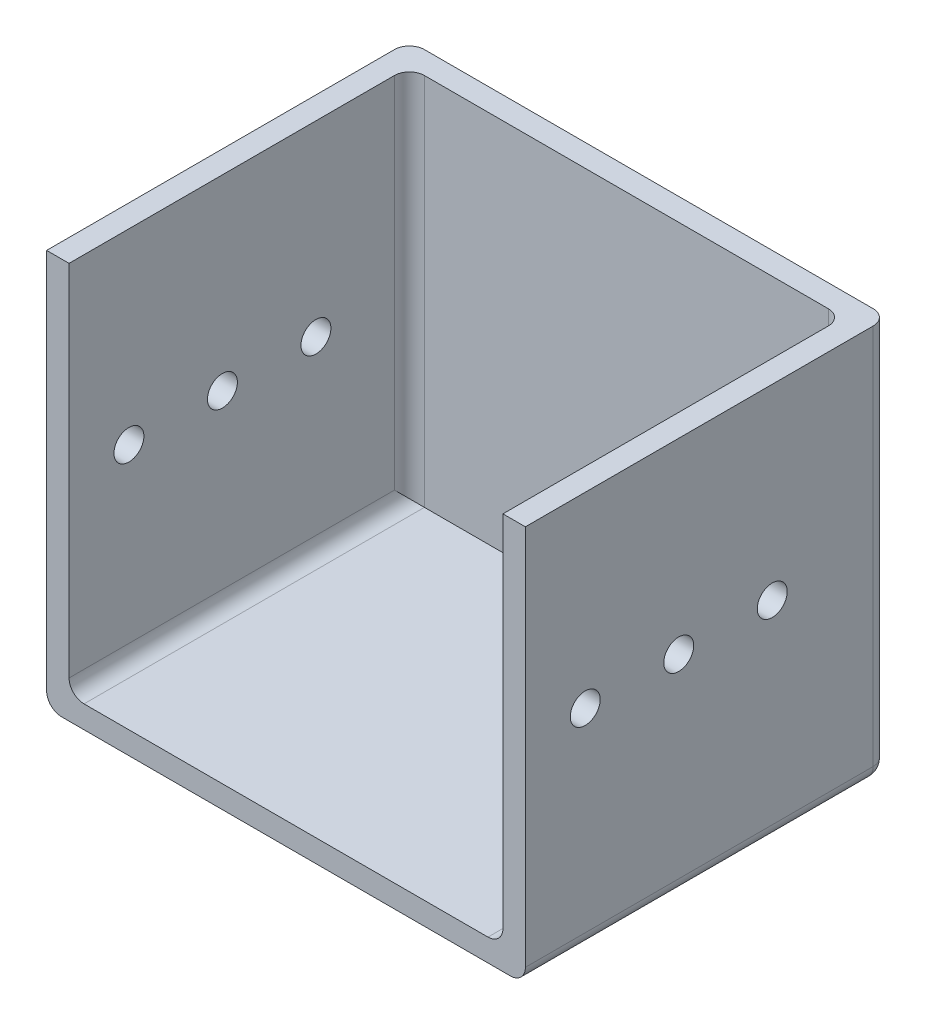
ISO-10303-21;
HEADER;
FILE_DESCRIPTION(('STEP AP214'),'2;1');
FILE_NAME('part.step','',(''),(''),'','','');
FILE_SCHEMA(('AUTOMOTIVE_DESIGN { 1 0 10303 214 1 1 1 1 }'));
ENDSEC;
DATA;
#1=APPLICATION_CONTEXT('core data for automotive mechanical design processes');
#2=APPLICATION_PROTOCOL_DEFINITION('international standard','automotive_design',2000,#1);
#3=PRODUCT_CONTEXT('',#1,'mechanical');
#4=PRODUCT('Part','Part','',(#3));
#5=PRODUCT_RELATED_PRODUCT_CATEGORY('part','',(#4));
#6=PRODUCT_DEFINITION_FORMATION('','',#4);
#7=PRODUCT_DEFINITION_CONTEXT('part definition',#1,'design');
#8=PRODUCT_DEFINITION('design','',#6,#7);
#9=PRODUCT_DEFINITION_SHAPE('','',#8);
#10=(LENGTH_UNIT() NAMED_UNIT(*) SI_UNIT(.MILLI.,.METRE.));
#11=(NAMED_UNIT(*) PLANE_ANGLE_UNIT() SI_UNIT($,.RADIAN.));
#12=(NAMED_UNIT(*) SI_UNIT($,.STERADIAN.) SOLID_ANGLE_UNIT());
#13=UNCERTAINTY_MEASURE_WITH_UNIT(LENGTH_MEASURE(1.E-05),#10,'distance_accuracy_value','');
#14=(GEOMETRIC_REPRESENTATION_CONTEXT(3) GLOBAL_UNCERTAINTY_ASSIGNED_CONTEXT((#13)) GLOBAL_UNIT_ASSIGNED_CONTEXT((#10,
#11,#12)) REPRESENTATION_CONTEXT('',''));
#15=CARTESIAN_POINT('',(0.,0.,0.));
#16=DIRECTION('',(0.,0.,1.));
#17=DIRECTION('',(1.,0.,0.));
#18=AXIS2_PLACEMENT_3D('',#15,#16,#17);
#19=CARTESIAN_POINT('',(-32.,3.,24.25));
#20=DIRECTION('',(1.,0.,0.));
#21=DIRECTION('',(0.,0.,-1.));
#22=AXIS2_PLACEMENT_3D('',#19,#20,#21);
#23=PLANE('',#22);
#24=CARTESIAN_POINT('',(-32.,28.,-8.75));
#25=DIRECTION('',(1.,0.,0.));
#26=DIRECTION('',(0.,0.,-1.));
#27=AXIS2_PLACEMENT_3D('',#24,#25,#26);
#28=CIRCLE('',#27,2.00000000000001);
#29=CARTESIAN_POINT('',(-32.,28.,-10.75));
#30=VERTEX_POINT('',#29);
#31=EDGE_CURVE('E218',#30,#30,#28,.T.);
#32=ORIENTED_EDGE('',*,*,#31,.T.);
#33=EDGE_LOOP('',(#32));
#34=FACE_BOUND('',#33,.T.);
#35=CARTESIAN_POINT('',(-32.,27.9999999999999,3.75));
#36=DIRECTION('',(1.,0.,0.));
#37=DIRECTION('',(0.,0.,-1.));
#38=AXIS2_PLACEMENT_3D('',#35,#36,#37);
#39=CIRCLE('',#38,2.00000000000001);
#40=CARTESIAN_POINT('',(-32.,27.9999999999999,1.74999999999999));
#41=VERTEX_POINT('',#40);
#42=EDGE_CURVE('E381',#41,#41,#39,.T.);
#43=ORIENTED_EDGE('',*,*,#42,.T.);
#44=EDGE_LOOP('',(#43));
#45=FACE_BOUND('',#44,.T.);
#46=CARTESIAN_POINT('',(-32.,27.9999999999998,16.25));
#47=DIRECTION('',(1.,0.,0.));
#48=DIRECTION('',(0.,0.,-1.));
#49=AXIS2_PLACEMENT_3D('',#46,#47,#48);
#50=CIRCLE('',#49,2.00000000000001);
#51=CARTESIAN_POINT('',(-32.,27.9999999999998,14.25));
#52=VERTEX_POINT('',#51);
#53=EDGE_CURVE('E373',#52,#52,#50,.T.);
#54=ORIENTED_EDGE('',*,*,#53,.T.);
#55=EDGE_LOOP('',(#54));
#56=FACE_BOUND('',#55,.T.);
#57=DIRECTION('',(0.,-1.,0.));
#58=VECTOR('',#57,1.);
#59=CARTESIAN_POINT('',(-32.,3.,-22.25));
#60=LINE('',#59,#58);
#61=CARTESIAN_POINT('',(-32.,53.,-22.25));
#62=VERTEX_POINT('',#61);
#63=CARTESIAN_POINT('',(-32.,2.,-22.25));
#64=VERTEX_POINT('',#63);
#65=EDGE_CURVE('E212',#62,#64,#60,.T.);
#66=ORIENTED_EDGE('',*,*,#65,.T.);
#67=DIRECTION('',(0.,0.,1.));
#68=VECTOR('',#67,1.);
#69=CARTESIAN_POINT('',(-32.,2.,24.25));
#70=LINE('',#69,#68);
#71=CARTESIAN_POINT('',(-32.,2.,24.25));
#72=VERTEX_POINT('',#71);
#73=EDGE_CURVE('E231',#64,#72,#70,.T.);
#74=ORIENTED_EDGE('',*,*,#73,.T.);
#75=DIRECTION('',(0.,-1.,0.));
#76=VECTOR('',#75,1.);
#77=CARTESIAN_POINT('',(-32.,3.,24.25));
#78=LINE('',#77,#76);
#79=CARTESIAN_POINT('',(-32.,53.,24.25));
#80=VERTEX_POINT('',#79);
#81=EDGE_CURVE('E202',#80,#72,#78,.T.);
#82=ORIENTED_EDGE('',*,*,#81,.F.);
#83=DIRECTION('',(0.,0.,1.));
#84=VECTOR('',#83,1.);
#85=CARTESIAN_POINT('',(-32.,53.,24.25));
#86=LINE('',#85,#84);
#87=EDGE_CURVE('E171',#62,#80,#86,.T.);
#88=ORIENTED_EDGE('',*,*,#87,.F.);
#89=EDGE_LOOP('',(#66,#74,#82,#88));
#90=FACE_BOUND('',#89,.T.);
#91=ADVANCED_FACE('F43',(#34,#45,#56,#90),#23,.F.);
#92=CARTESIAN_POINT('',(32.,3.,24.25));
#93=DIRECTION('',(0.,0.,-1.));
#94=DIRECTION('',(-1.,0.,0.));
#95=AXIS2_PLACEMENT_3D('',#92,#93,#94);
#96=PLANE('',#95);
#97=ORIENTED_EDGE('',*,*,#81,.T.);
#98=CARTESIAN_POINT('',(-30.,2.,24.25));
#99=DIRECTION('',(0.,0.,-1.));
#100=DIRECTION('',(-1.,0.,0.));
#101=AXIS2_PLACEMENT_3D('',#98,#99,#100);
#102=CIRCLE('',#101,2.);
#103=CARTESIAN_POINT('',(-30.,0.,24.25));
#104=VERTEX_POINT('',#103);
#105=EDGE_CURVE('E238',#72,#104,#102,.F.);
#106=ORIENTED_EDGE('',*,*,#105,.T.);
#107=DIRECTION('',(1.,0.,0.));
#108=VECTOR('',#107,1.);
#109=CARTESIAN_POINT('',(32.,0.,24.25));
#110=LINE('',#109,#108);
#111=CARTESIAN_POINT('',(30.,0.,24.25));
#112=VERTEX_POINT('',#111);
#113=EDGE_CURVE('E183',#104,#112,#110,.T.);
#114=ORIENTED_EDGE('',*,*,#113,.T.);
#115=CARTESIAN_POINT('',(30.,2.,24.25));
#116=DIRECTION('',(0.,0.,-1.));
#117=DIRECTION('',(-1.,0.,0.));
#118=AXIS2_PLACEMENT_3D('',#115,#116,#117);
#119=CIRCLE('',#118,2.);
#120=CARTESIAN_POINT('',(32.,2.,24.25));
#121=VERTEX_POINT('',#120);
#122=EDGE_CURVE('E235',#112,#121,#119,.F.);
#123=ORIENTED_EDGE('',*,*,#122,.T.);
#124=DIRECTION('',(0.,-1.,0.));
#125=VECTOR('',#124,1.);
#126=CARTESIAN_POINT('',(32.,3.,24.25));
#127=LINE('',#126,#125);
#128=CARTESIAN_POINT('',(32.,53.,24.25));
#129=VERTEX_POINT('',#128);
#130=EDGE_CURVE('E197',#129,#121,#127,.T.);
#131=ORIENTED_EDGE('',*,*,#130,.F.);
#132=DIRECTION('',(1.,0.,0.));
#133=VECTOR('',#132,1.);
#134=CARTESIAN_POINT('',(32.,53.,24.25));
#135=LINE('',#134,#133);
#136=CARTESIAN_POINT('',(29.,53.,24.25));
#137=VERTEX_POINT('',#136);
#138=EDGE_CURVE('E344',#137,#129,#135,.T.);
#139=ORIENTED_EDGE('',*,*,#138,.F.);
#140=DIRECTION('',(0.,-1.,0.));
#141=VECTOR('',#140,1.);
#142=CARTESIAN_POINT('',(29.,53.,24.25));
#143=LINE('',#142,#141);
#144=CARTESIAN_POINT('',(29.,5.,24.25));
#145=VERTEX_POINT('',#144);
#146=EDGE_CURVE('E184',#137,#145,#143,.T.);
#147=ORIENTED_EDGE('',*,*,#146,.T.);
#148=CARTESIAN_POINT('',(27.,5.,24.25));
#149=DIRECTION('',(0.,0.,-1.));
#150=DIRECTION('',(-1.,0.,0.));
#151=AXIS2_PLACEMENT_3D('',#148,#149,#150);
#152=CIRCLE('',#151,2.);
#153=CARTESIAN_POINT('',(27.,3.,24.25));
#154=VERTEX_POINT('',#153);
#155=EDGE_CURVE('E296',#145,#154,#152,.T.);
#156=ORIENTED_EDGE('',*,*,#155,.T.);
#157=DIRECTION('',(1.,0.,0.));
#158=VECTOR('',#157,1.);
#159=CARTESIAN_POINT('',(32.,3.,24.25));
#160=LINE('',#159,#158);
#161=CARTESIAN_POINT('',(-27.,3.,24.25));
#162=VERTEX_POINT('',#161);
#163=EDGE_CURVE('E189',#162,#154,#160,.T.);
#164=ORIENTED_EDGE('',*,*,#163,.F.);
#165=CARTESIAN_POINT('',(-27.,5.,24.25));
#166=DIRECTION('',(0.,0.,-1.));
#167=DIRECTION('',(-1.,0.,0.));
#168=AXIS2_PLACEMENT_3D('',#165,#166,#167);
#169=CIRCLE('',#168,2.);
#170=CARTESIAN_POINT('',(-29.,5.,24.25));
#171=VERTEX_POINT('',#170);
#172=EDGE_CURVE('E181',#162,#171,#169,.T.);
#173=ORIENTED_EDGE('',*,*,#172,.T.);
#174=DIRECTION('',(0.,-1.,0.));
#175=VECTOR('',#174,1.);
#176=CARTESIAN_POINT('',(-29.,53.,24.25));
#177=LINE('',#176,#175);
#178=CARTESIAN_POINT('',(-29.,53.,24.25));
#179=VERTEX_POINT('',#178);
#180=EDGE_CURVE('E159',#179,#171,#177,.T.);
#181=ORIENTED_EDGE('',*,*,#180,.F.);
#182=DIRECTION('',(1.,0.,0.));
#183=VECTOR('',#182,1.);
#184=CARTESIAN_POINT('',(-32.,53.,24.25));
#185=LINE('',#184,#183);
#186=EDGE_CURVE('E166',#80,#179,#185,.T.);
#187=ORIENTED_EDGE('',*,*,#186,.F.);
#188=EDGE_LOOP('',(#97,#106,#114,#123,#131,#139,#147,#156,#164,#173,#181,#187));
#189=FACE_BOUND('',#188,.T.);
#190=ADVANCED_FACE('F178',(#189),#96,.F.);
#191=CARTESIAN_POINT('',(32.,3.,24.25));
#192=DIRECTION('',(-1.,0.,0.));
#193=DIRECTION('',(0.,0.,1.));
#194=AXIS2_PLACEMENT_3D('',#191,#192,#193);
#195=PLANE('',#194);
#196=CARTESIAN_POINT('',(32.,28.,-8.75));
#197=DIRECTION('',(1.,0.,0.));
#198=DIRECTION('',(0.,0.,-1.));
#199=AXIS2_PLACEMENT_3D('',#196,#197,#198);
#200=CIRCLE('',#199,2.00000000000001);
#201=CARTESIAN_POINT('',(32.,28.,-10.75));
#202=VERTEX_POINT('',#201);
#203=EDGE_CURVE('E385',#202,#202,#200,.T.);
#204=ORIENTED_EDGE('',*,*,#203,.F.);
#205=EDGE_LOOP('',(#204));
#206=FACE_BOUND('',#205,.T.);
#207=CARTESIAN_POINT('',(32.,27.9999999999999,3.75));
#208=DIRECTION('',(1.,0.,0.));
#209=DIRECTION('',(0.,0.,-1.));
#210=AXIS2_PLACEMENT_3D('',#207,#208,#209);
#211=CIRCLE('',#210,2.00000000000001);
#212=CARTESIAN_POINT('',(32.,27.9999999999999,1.74999999999999));
#213=VERTEX_POINT('',#212);
#214=EDGE_CURVE('E377',#213,#213,#211,.T.);
#215=ORIENTED_EDGE('',*,*,#214,.F.);
#216=EDGE_LOOP('',(#215));
#217=FACE_BOUND('',#216,.T.);
#218=CARTESIAN_POINT('',(32.,27.9999999999998,16.25));
#219=DIRECTION('',(1.,0.,0.));
#220=DIRECTION('',(0.,0.,-1.));
#221=AXIS2_PLACEMENT_3D('',#218,#219,#220);
#222=CIRCLE('',#221,2.00000000000001);
#223=CARTESIAN_POINT('',(32.,27.9999999999998,14.25));
#224=VERTEX_POINT('',#223);
#225=EDGE_CURVE('E310',#224,#224,#222,.T.);
#226=ORIENTED_EDGE('',*,*,#225,.F.);
#227=EDGE_LOOP('',(#226));
#228=FACE_BOUND('',#227,.T.);
#229=ORIENTED_EDGE('',*,*,#130,.T.);
#230=DIRECTION('',(0.,0.,-1.));
#231=VECTOR('',#230,1.);
#232=CARTESIAN_POINT('',(32.,2.,24.25));
#233=LINE('',#232,#231);
#234=CARTESIAN_POINT('',(32.,2.,-22.25));
#235=VERTEX_POINT('',#234);
#236=EDGE_CURVE('E256',#121,#235,#233,.T.);
#237=ORIENTED_EDGE('',*,*,#236,.T.);
#238=DIRECTION('',(0.,-1.,0.));
#239=VECTOR('',#238,1.);
#240=CARTESIAN_POINT('',(32.,3.,-22.25));
#241=LINE('',#240,#239);
#242=CARTESIAN_POINT('',(32.,53.,-22.25));
#243=VERTEX_POINT('',#242);
#244=EDGE_CURVE('E253',#235,#243,#241,.F.);
#245=ORIENTED_EDGE('',*,*,#244,.T.);
#246=DIRECTION('',(0.,0.,-1.));
#247=VECTOR('',#246,1.);
#248=CARTESIAN_POINT('',(32.,53.,-24.25));
#249=LINE('',#248,#247);
#250=EDGE_CURVE('E350',#129,#243,#249,.T.);
#251=ORIENTED_EDGE('',*,*,#250,.F.);
#252=EDGE_LOOP('',(#229,#237,#245,#251));
#253=FACE_BOUND('',#252,.T.);
#254=ADVANCED_FACE('F420',(#206,#217,#228,#253),#195,.F.);
#255=CARTESIAN_POINT('',(32.,3.,-24.25));
#256=DIRECTION('',(0.,0.,1.));
#257=DIRECTION('',(1.,0.,0.));
#258=AXIS2_PLACEMENT_3D('',#255,#256,#257);
#259=PLANE('',#258);
#260=DIRECTION('',(-1.,0.,0.));
#261=VECTOR('',#260,1.);
#262=CARTESIAN_POINT('',(32.,2.,-24.25));
#263=LINE('',#262,#261);
#264=CARTESIAN_POINT('',(30.,2.,-24.25));
#265=VERTEX_POINT('',#264);
#266=CARTESIAN_POINT('',(-30.,2.,-24.25));
#267=VERTEX_POINT('',#266);
#268=EDGE_CURVE('E205',#265,#267,#263,.T.);
#269=ORIENTED_EDGE('',*,*,#268,.T.);
#270=DIRECTION('',(0.,-1.,0.));
#271=VECTOR('',#270,1.);
#272=CARTESIAN_POINT('',(-30.,3.,-24.25));
#273=LINE('',#272,#271);
#274=CARTESIAN_POINT('',(-30.,53.,-24.25));
#275=VERTEX_POINT('',#274);
#276=EDGE_CURVE('E61',#267,#275,#273,.F.);
#277=ORIENTED_EDGE('',*,*,#276,.T.);
#278=DIRECTION('',(-1.,0.,0.));
#279=VECTOR('',#278,1.);
#280=CARTESIAN_POINT('',(-32.,53.,-24.25));
#281=LINE('',#280,#279);
#282=CARTESIAN_POINT('',(30.,53.,-24.25));
#283=VERTEX_POINT('',#282);
#284=EDGE_CURVE('E353',#283,#275,#281,.T.);
#285=ORIENTED_EDGE('',*,*,#284,.F.);
#286=DIRECTION('',(0.,-1.,0.));
#287=VECTOR('',#286,1.);
#288=CARTESIAN_POINT('',(30.,3.,-24.25));
#289=LINE('',#288,#287);
#290=EDGE_CURVE('E284',#283,#265,#289,.T.);
#291=ORIENTED_EDGE('',*,*,#290,.T.);
#292=EDGE_LOOP('',(#269,#277,#285,#291));
#293=FACE_BOUND('',#292,.T.);
#294=ADVANCED_FACE('F557',(#293),#259,.F.);
#295=CARTESIAN_POINT('',(0.,3.,0.));
#296=DIRECTION('',(0.,1.,0.));
#297=DIRECTION('',(0.,0.,1.));
#298=AXIS2_PLACEMENT_3D('',#295,#296,#297);
#299=PLANE('',#298);
#300=DIRECTION('',(1.,0.,0.));
#301=VECTOR('',#300,1.);
#302=CARTESIAN_POINT('',(-29.,3.,-21.25));
#303=LINE('',#302,#301);
#304=CARTESIAN_POINT('',(-27.,3.,-21.25));
#305=VERTEX_POINT('',#304);
#306=CARTESIAN_POINT('',(27.,3.,-21.25));
#307=VERTEX_POINT('',#306);
#308=EDGE_CURVE('E176',#305,#307,#303,.T.);
#309=ORIENTED_EDGE('',*,*,#308,.F.);
#310=DIRECTION('',(0.,0.,-1.));
#311=VECTOR('',#310,1.);
#312=CARTESIAN_POINT('',(-27.,3.,0.));
#313=LINE('',#312,#311);
#314=EDGE_CURVE('E268',#305,#162,#313,.F.);
#315=ORIENTED_EDGE('',*,*,#314,.T.);
#316=ORIENTED_EDGE('',*,*,#163,.T.);
#317=DIRECTION('',(0.,0.,1.));
#318=VECTOR('',#317,1.);
#319=CARTESIAN_POINT('',(27.,3.,0.));
#320=LINE('',#319,#318);
#321=EDGE_CURVE('E265',#154,#307,#320,.F.);
#322=ORIENTED_EDGE('',*,*,#321,.T.);
#323=EDGE_LOOP('',(#309,#315,#316,#322));
#324=FACE_BOUND('',#323,.T.);
#325=ADVANCED_FACE('F546',(#324),#299,.T.);
#326=CARTESIAN_POINT('',(0.,0.,0.));
#327=DIRECTION('',(0.,1.,0.));
#328=DIRECTION('',(0.,0.,1.));
#329=AXIS2_PLACEMENT_3D('',#326,#327,#328);
#330=PLANE('',#329);
#331=ORIENTED_EDGE('',*,*,#113,.F.);
#332=DIRECTION('',(0.,0.,1.));
#333=VECTOR('',#332,1.);
#334=CARTESIAN_POINT('',(-30.,0.,0.));
#335=LINE('',#334,#333);
#336=CARTESIAN_POINT('',(-30.,0.,-22.25));
#337=VERTEX_POINT('',#336);
#338=EDGE_CURVE('E244',#104,#337,#335,.F.);
#339=ORIENTED_EDGE('',*,*,#338,.T.);
#340=DIRECTION('',(-1.,0.,0.));
#341=VECTOR('',#340,1.);
#342=CARTESIAN_POINT('',(0.,0.,-22.25));
#343=LINE('',#342,#341);
#344=CARTESIAN_POINT('',(30.,0.,-22.25));
#345=VERTEX_POINT('',#344);
#346=EDGE_CURVE('E208',#337,#345,#343,.F.);
#347=ORIENTED_EDGE('',*,*,#346,.T.);
#348=DIRECTION('',(0.,0.,-1.));
#349=VECTOR('',#348,1.);
#350=CARTESIAN_POINT('',(30.,0.,0.));
#351=LINE('',#350,#349);
#352=EDGE_CURVE('E241',#345,#112,#351,.F.);
#353=ORIENTED_EDGE('',*,*,#352,.T.);
#354=EDGE_LOOP('',(#331,#339,#347,#353));
#355=FACE_BOUND('',#354,.T.);
#356=ADVANCED_FACE('F536',(#355),#330,.F.);
#357=CARTESIAN_POINT('',(-29.,53.,24.25));
#358=DIRECTION('',(-1.,0.,0.));
#359=DIRECTION('',(0.,0.,1.));
#360=AXIS2_PLACEMENT_3D('',#357,#358,#359);
#361=PLANE('',#360);
#362=CARTESIAN_POINT('',(-29.,28.,-8.75));
#363=DIRECTION('',(-1.,0.,0.));
#364=DIRECTION('',(0.,0.,1.));
#365=AXIS2_PLACEMENT_3D('',#362,#363,#364);
#366=CIRCLE('',#365,2.00000000000001);
#367=CARTESIAN_POINT('',(-29.,28.,-6.74999999999999));
#368=VERTEX_POINT('',#367);
#369=EDGE_CURVE('E228',#368,#368,#366,.T.);
#370=ORIENTED_EDGE('',*,*,#369,.T.);
#371=EDGE_LOOP('',(#370));
#372=FACE_BOUND('',#371,.T.);
#373=CARTESIAN_POINT('',(-29.,27.9999999999999,3.75));
#374=DIRECTION('',(-1.,0.,0.));
#375=DIRECTION('',(0.,0.,1.));
#376=AXIS2_PLACEMENT_3D('',#373,#374,#375);
#377=CIRCLE('',#376,2.00000000000001);
#378=CARTESIAN_POINT('',(-29.,27.9999999999999,5.75000000000001));
#379=VERTEX_POINT('',#378);
#380=EDGE_CURVE('E223',#379,#379,#377,.T.);
#381=ORIENTED_EDGE('',*,*,#380,.T.);
#382=EDGE_LOOP('',(#381));
#383=FACE_BOUND('',#382,.T.);
#384=CARTESIAN_POINT('',(-29.,27.9999999999998,16.25));
#385=DIRECTION('',(-1.,0.,0.));
#386=DIRECTION('',(0.,0.,1.));
#387=AXIS2_PLACEMENT_3D('',#384,#385,#386);
#388=CIRCLE('',#387,2.00000000000001);
#389=CARTESIAN_POINT('',(-29.,27.9999999999998,18.25));
#390=VERTEX_POINT('',#389);
#391=EDGE_CURVE('E217',#390,#390,#388,.T.);
#392=ORIENTED_EDGE('',*,*,#391,.T.);
#393=EDGE_LOOP('',(#392));
#394=FACE_BOUND('',#393,.T.);
#395=ORIENTED_EDGE('',*,*,#180,.T.);
#396=DIRECTION('',(0.,0.,-1.));
#397=VECTOR('',#396,1.);
#398=CARTESIAN_POINT('',(-29.,5.,24.25));
#399=LINE('',#398,#397);
#400=CARTESIAN_POINT('',(-29.,5.,-19.25));
#401=VERTEX_POINT('',#400);
#402=EDGE_CURVE('E262',#171,#401,#399,.T.);
#403=ORIENTED_EDGE('',*,*,#402,.T.);
#404=DIRECTION('',(0.,-1.,0.));
#405=VECTOR('',#404,1.);
#406=CARTESIAN_POINT('',(-29.,53.,-19.25));
#407=LINE('',#406,#405);
#408=CARTESIAN_POINT('',(-29.,53.,-19.25));
#409=VERTEX_POINT('',#408);
#410=EDGE_CURVE('E162',#401,#409,#407,.F.);
#411=ORIENTED_EDGE('',*,*,#410,.T.);
#412=DIRECTION('',(0.,0.,-1.));
#413=VECTOR('',#412,1.);
#414=CARTESIAN_POINT('',(-29.,53.,24.25));
#415=LINE('',#414,#413);
#416=EDGE_CURVE('E154',#179,#409,#415,.T.);
#417=ORIENTED_EDGE('',*,*,#416,.F.);
#418=EDGE_LOOP('',(#395,#403,#411,#417));
#419=FACE_BOUND('',#418,.T.);
#420=ADVANCED_FACE('F156',(#372,#383,#394,#419),#361,.F.);
#421=CARTESIAN_POINT('',(-29.,53.,-21.25));
#422=DIRECTION('',(0.,0.,-1.));
#423=DIRECTION('',(-1.,0.,0.));
#424=AXIS2_PLACEMENT_3D('',#421,#422,#423);
#425=PLANE('',#424);
#426=DIRECTION('',(1.,0.,0.));
#427=VECTOR('',#426,1.);
#428=CARTESIAN_POINT('',(-29.,53.,-21.25));
#429=LINE('',#428,#427);
#430=CARTESIAN_POINT('',(-27.,53.,-21.25));
#431=VERTEX_POINT('',#430);
#432=CARTESIAN_POINT('',(27.,53.,-21.25));
#433=VERTEX_POINT('',#432);
#434=EDGE_CURVE('E165',#431,#433,#429,.T.);
#435=ORIENTED_EDGE('',*,*,#434,.F.);
#436=DIRECTION('',(0.,-1.,0.));
#437=VECTOR('',#436,1.);
#438=CARTESIAN_POINT('',(-27.,3.,-21.25));
#439=LINE('',#438,#437);
#440=EDGE_CURVE('E281',#431,#305,#439,.T.);
#441=ORIENTED_EDGE('',*,*,#440,.T.);
#442=ORIENTED_EDGE('',*,*,#308,.T.);
#443=DIRECTION('',(0.,-1.,0.));
#444=VECTOR('',#443,1.);
#445=CARTESIAN_POINT('',(27.,53.,-21.25));
#446=LINE('',#445,#444);
#447=EDGE_CURVE('E278',#307,#433,#446,.F.);
#448=ORIENTED_EDGE('',*,*,#447,.T.);
#449=EDGE_LOOP('',(#435,#441,#442,#448));
#450=FACE_BOUND('',#449,.T.);
#451=ADVANCED_FACE('F336',(#450),#425,.F.);
#452=CARTESIAN_POINT('',(29.,53.,-21.25));
#453=DIRECTION('',(1.,0.,0.));
#454=DIRECTION('',(0.,0.,-1.));
#455=AXIS2_PLACEMENT_3D('',#452,#453,#454);
#456=PLANE('',#455);
#457=CARTESIAN_POINT('',(29.,28.,-8.75));
#458=DIRECTION('',(1.,0.,0.));
#459=DIRECTION('',(0.,0.,-1.));
#460=AXIS2_PLACEMENT_3D('',#457,#458,#459);
#461=CIRCLE('',#460,2.00000000000001);
#462=CARTESIAN_POINT('',(29.,28.,-10.75));
#463=VERTEX_POINT('',#462);
#464=EDGE_CURVE('E224',#463,#463,#461,.T.);
#465=ORIENTED_EDGE('',*,*,#464,.T.);
#466=EDGE_LOOP('',(#465));
#467=FACE_BOUND('',#466,.T.);
#468=CARTESIAN_POINT('',(29.,27.9999999999999,3.75));
#469=DIRECTION('',(1.,0.,0.));
#470=DIRECTION('',(0.,0.,-1.));
#471=AXIS2_PLACEMENT_3D('',#468,#469,#470);
#472=CIRCLE('',#471,2.00000000000001);
#473=CARTESIAN_POINT('',(29.,27.9999999999999,1.74999999999999));
#474=VERTEX_POINT('',#473);
#475=EDGE_CURVE('E219',#474,#474,#472,.T.);
#476=ORIENTED_EDGE('',*,*,#475,.T.);
#477=EDGE_LOOP('',(#476));
#478=FACE_BOUND('',#477,.T.);
#479=CARTESIAN_POINT('',(29.,27.9999999999998,16.25));
#480=DIRECTION('',(1.,0.,0.));
#481=DIRECTION('',(0.,0.,-1.));
#482=AXIS2_PLACEMENT_3D('',#479,#480,#481);
#483=CIRCLE('',#482,2.00000000000001);
#484=CARTESIAN_POINT('',(29.,27.9999999999998,14.25));
#485=VERTEX_POINT('',#484);
#486=EDGE_CURVE('E213',#485,#485,#483,.T.);
#487=ORIENTED_EDGE('',*,*,#486,.T.);
#488=EDGE_LOOP('',(#487));
#489=FACE_BOUND('',#488,.T.);
#490=DIRECTION('',(0.,-1.,0.));
#491=VECTOR('',#490,1.);
#492=CARTESIAN_POINT('',(29.,3.,-19.25));
#493=LINE('',#492,#491);
#494=CARTESIAN_POINT('',(29.,53.,-19.25));
#495=VERTEX_POINT('',#494);
#496=CARTESIAN_POINT('',(29.,5.,-19.25));
#497=VERTEX_POINT('',#496);
#498=EDGE_CURVE('E271',#495,#497,#493,.T.);
#499=ORIENTED_EDGE('',*,*,#498,.T.);
#500=DIRECTION('',(0.,0.,1.));
#501=VECTOR('',#500,1.);
#502=CARTESIAN_POINT('',(29.,5.,-21.25));
#503=LINE('',#502,#501);
#504=EDGE_CURVE('E274',#497,#145,#503,.T.);
#505=ORIENTED_EDGE('',*,*,#504,.T.);
#506=ORIENTED_EDGE('',*,*,#146,.F.);
#507=DIRECTION('',(0.,0.,1.));
#508=VECTOR('',#507,1.);
#509=CARTESIAN_POINT('',(29.,53.,-21.25));
#510=LINE('',#509,#508);
#511=EDGE_CURVE('E341',#495,#137,#510,.T.);
#512=ORIENTED_EDGE('',*,*,#511,.F.);
#513=EDGE_LOOP('',(#499,#505,#506,#512));
#514=FACE_BOUND('',#513,.T.);
#515=ADVANCED_FACE('F510',(#467,#478,#489,#514),#456,.F.);
#516=CARTESIAN_POINT('',(0.,53.,0.));
#517=DIRECTION('',(0.,1.,0.));
#518=DIRECTION('',(0.,0.,1.));
#519=AXIS2_PLACEMENT_3D('',#516,#517,#518);
#520=PLANE('',#519);
#521=ORIENTED_EDGE('',*,*,#284,.T.);
#522=CARTESIAN_POINT('',(-30.,53.,-22.25));
#523=DIRECTION('',(0.,1.,0.));
#524=DIRECTION('',(0.,0.,1.));
#525=AXIS2_PLACEMENT_3D('',#522,#523,#524);
#526=CIRCLE('',#525,2.);
#527=EDGE_CURVE('E291',#275,#62,#526,.T.);
#528=ORIENTED_EDGE('',*,*,#527,.T.);
#529=ORIENTED_EDGE('',*,*,#87,.T.);
#530=ORIENTED_EDGE('',*,*,#186,.T.);
#531=ORIENTED_EDGE('',*,*,#416,.T.);
#532=CARTESIAN_POINT('',(-27.,53.,-19.25));
#533=DIRECTION('',(0.,1.,0.));
#534=DIRECTION('',(0.,0.,1.));
#535=AXIS2_PLACEMENT_3D('',#532,#533,#534);
#536=CIRCLE('',#535,2.);
#537=EDGE_CURVE('E53',#409,#431,#536,.F.);
#538=ORIENTED_EDGE('',*,*,#537,.T.);
#539=ORIENTED_EDGE('',*,*,#434,.T.);
#540=CARTESIAN_POINT('',(27.,53.,-19.25));
#541=DIRECTION('',(0.,1.,0.));
#542=DIRECTION('',(0.,0.,1.));
#543=AXIS2_PLACEMENT_3D('',#540,#541,#542);
#544=CIRCLE('',#543,2.);
#545=EDGE_CURVE('E11',#433,#495,#544,.F.);
#546=ORIENTED_EDGE('',*,*,#545,.T.);
#547=ORIENTED_EDGE('',*,*,#511,.T.);
#548=ORIENTED_EDGE('',*,*,#138,.T.);
#549=ORIENTED_EDGE('',*,*,#250,.T.);
#550=CARTESIAN_POINT('',(30.,53.,-22.25));
#551=DIRECTION('',(0.,1.,0.));
#552=DIRECTION('',(0.,0.,1.));
#553=AXIS2_PLACEMENT_3D('',#550,#551,#552);
#554=CIRCLE('',#553,2.);
#555=EDGE_CURVE('E68',#243,#283,#554,.T.);
#556=ORIENTED_EDGE('',*,*,#555,.T.);
#557=EDGE_LOOP('',(#521,#528,#529,#530,#531,#538,#539,#546,#547,#548,#549,#556));
#558=FACE_BOUND('',#557,.T.);
#559=ADVANCED_FACE('F169',(#558),#520,.T.);
#560=CARTESIAN_POINT('',(32.,2.,-22.25));
#561=DIRECTION('',(-1.,0.,0.));
#562=DIRECTION('',(0.,0.,1.));
#563=AXIS2_PLACEMENT_3D('',#560,#561,#562);
#564=CYLINDRICAL_SURFACE('',#563,2.);
#565=ORIENTED_EDGE('',*,*,#346,.F.);
#566=CARTESIAN_POINT('',(-30.,2.,-22.25));
#567=DIRECTION('',(-1.,0.,0.));
#568=DIRECTION('',(0.,0.,1.));
#569=AXIS2_PLACEMENT_3D('',#566,#567,#568);
#570=CIRCLE('',#569,2.);
#571=EDGE_CURVE('E250',#337,#267,#570,.F.);
#572=ORIENTED_EDGE('',*,*,#571,.T.);
#573=ORIENTED_EDGE('',*,*,#268,.F.);
#574=CARTESIAN_POINT('',(30.,2.,-22.25));
#575=DIRECTION('',(-1.,0.,0.));
#576=DIRECTION('',(0.,0.,1.));
#577=AXIS2_PLACEMENT_3D('',#574,#575,#576);
#578=CIRCLE('',#577,2.);
#579=EDGE_CURVE('E247',#265,#345,#578,.T.);
#580=ORIENTED_EDGE('',*,*,#579,.T.);
#581=EDGE_LOOP('',(#565,#572,#573,#580));
#582=FACE_BOUND('',#581,.T.);
#583=ADVANCED_FACE('F424',(#582),#564,.T.);
#584=CARTESIAN_POINT('',(-32.,27.9999999999998,16.25));
#585=DIRECTION('',(1.,0.,0.));
#586=DIRECTION('',(0.,0.,-1.));
#587=AXIS2_PLACEMENT_3D('',#584,#585,#586);
#588=CYLINDRICAL_SURFACE('',#587,2.00000000000001);
#589=ORIENTED_EDGE('',*,*,#225,.T.);
#590=EDGE_LOOP('',(#589));
#591=FACE_BOUND('',#590,.T.);
#592=ORIENTED_EDGE('',*,*,#486,.F.);
#593=EDGE_LOOP('',(#592));
#594=FACE_BOUND('',#593,.T.);
#595=ADVANCED_FACE('F427',(#591,#594),#588,.F.);
#596=CARTESIAN_POINT('',(-32.,27.9999999999999,3.75));
#597=DIRECTION('',(1.,0.,0.));
#598=DIRECTION('',(0.,0.,-1.));
#599=AXIS2_PLACEMENT_3D('',#596,#597,#598);
#600=CYLINDRICAL_SURFACE('',#599,2.00000000000001);
#601=ORIENTED_EDGE('',*,*,#214,.T.);
#602=EDGE_LOOP('',(#601));
#603=FACE_BOUND('',#602,.T.);
#604=ORIENTED_EDGE('',*,*,#475,.F.);
#605=EDGE_LOOP('',(#604));
#606=FACE_BOUND('',#605,.T.);
#607=ADVANCED_FACE('F412',(#603,#606),#600,.F.);
#608=CARTESIAN_POINT('',(-32.,28.,-8.75));
#609=DIRECTION('',(1.,0.,0.));
#610=DIRECTION('',(0.,0.,-1.));
#611=AXIS2_PLACEMENT_3D('',#608,#609,#610);
#612=CYLINDRICAL_SURFACE('',#611,2.00000000000001);
#613=ORIENTED_EDGE('',*,*,#203,.T.);
#614=EDGE_LOOP('',(#613));
#615=FACE_BOUND('',#614,.T.);
#616=ORIENTED_EDGE('',*,*,#464,.F.);
#617=EDGE_LOOP('',(#616));
#618=FACE_BOUND('',#617,.T.);
#619=ADVANCED_FACE('F401',(#615,#618),#612,.F.);
#620=ORIENTED_EDGE('',*,*,#53,.F.);
#621=EDGE_LOOP('',(#620));
#622=FACE_BOUND('',#621,.T.);
#623=ORIENTED_EDGE('',*,*,#391,.F.);
#624=EDGE_LOOP('',(#623));
#625=FACE_BOUND('',#624,.T.);
#626=ADVANCED_FACE('F409',(#622,#625),#588,.F.);
#627=ORIENTED_EDGE('',*,*,#42,.F.);
#628=EDGE_LOOP('',(#627));
#629=FACE_BOUND('',#628,.T.);
#630=ORIENTED_EDGE('',*,*,#380,.F.);
#631=EDGE_LOOP('',(#630));
#632=FACE_BOUND('',#631,.T.);
#633=ADVANCED_FACE('F399',(#629,#632),#600,.F.);
#634=ORIENTED_EDGE('',*,*,#31,.F.);
#635=EDGE_LOOP('',(#634));
#636=FACE_BOUND('',#635,.T.);
#637=ORIENTED_EDGE('',*,*,#369,.F.);
#638=EDGE_LOOP('',(#637));
#639=FACE_BOUND('',#638,.T.);
#640=ADVANCED_FACE('F395',(#636,#639),#612,.F.);
#641=CARTESIAN_POINT('',(-30.,3.,-22.25));
#642=DIRECTION('',(0.,-1.,0.));
#643=DIRECTION('',(0.,0.,-1.));
#644=AXIS2_PLACEMENT_3D('',#641,#642,#643);
#645=CYLINDRICAL_SURFACE('',#644,2.);
#646=ORIENTED_EDGE('',*,*,#527,.F.);
#647=ORIENTED_EDGE('',*,*,#276,.F.);
#648=CARTESIAN_POINT('',(-30.,2.,-22.25));
#649=DIRECTION('',(0.,-1.,0.));
#650=DIRECTION('',(0.,0.,-1.));
#651=AXIS2_PLACEMENT_3D('',#648,#649,#650);
#652=CIRCLE('',#651,2.);
#653=EDGE_CURVE('E305',#64,#267,#652,.T.);
#654=ORIENTED_EDGE('',*,*,#653,.F.);
#655=ORIENTED_EDGE('',*,*,#65,.F.);
#656=EDGE_LOOP('',(#646,#647,#654,#655));
#657=FACE_BOUND('',#656,.T.);
#658=ADVANCED_FACE('F398',(#657),#645,.T.);
#659=CARTESIAN_POINT('',(-30.,2.,-22.25));
#660=DIRECTION('',(1.,0.,0.));
#661=DIRECTION('',(0.,0.,-1.));
#662=AXIS2_PLACEMENT_3D('',#659,#660,#661);
#663=SPHERICAL_SURFACE('',#662,2.);
#664=ORIENTED_EDGE('',*,*,#653,.T.);
#665=ORIENTED_EDGE('',*,*,#571,.F.);
#666=CARTESIAN_POINT('',(-30.,2.,-22.25));
#667=DIRECTION('',(0.,0.,1.));
#668=DIRECTION('',(1.,0.,0.));
#669=AXIS2_PLACEMENT_3D('',#666,#667,#668);
#670=CIRCLE('',#669,2.);
#671=EDGE_CURVE('E301',#64,#337,#670,.T.);
#672=ORIENTED_EDGE('',*,*,#671,.F.);
#673=EDGE_LOOP('',(#664,#665,#672));
#674=FACE_BOUND('',#673,.T.);
#675=ADVANCED_FACE('F406',(#674),#663,.T.);
#676=CARTESIAN_POINT('',(-30.,2.,24.25));
#677=DIRECTION('',(0.,0.,1.));
#678=DIRECTION('',(1.,0.,0.));
#679=AXIS2_PLACEMENT_3D('',#676,#677,#678);
#680=CYLINDRICAL_SURFACE('',#679,2.);
#681=ORIENTED_EDGE('',*,*,#671,.T.);
#682=ORIENTED_EDGE('',*,*,#338,.F.);
#683=ORIENTED_EDGE('',*,*,#105,.F.);
#684=ORIENTED_EDGE('',*,*,#73,.F.);
#685=EDGE_LOOP('',(#681,#682,#683,#684));
#686=FACE_BOUND('',#685,.T.);
#687=ADVANCED_FACE('F429',(#686),#680,.T.);
#688=CARTESIAN_POINT('',(30.,3.,-22.25));
#689=DIRECTION('',(0.,-1.,0.));
#690=DIRECTION('',(0.,0.,-1.));
#691=AXIS2_PLACEMENT_3D('',#688,#689,#690);
#692=CYLINDRICAL_SURFACE('',#691,2.);
#693=CARTESIAN_POINT('',(30.,2.,-22.25));
#694=DIRECTION('',(0.,-1.,0.));
#695=DIRECTION('',(0.,0.,-1.));
#696=AXIS2_PLACEMENT_3D('',#693,#694,#695);
#697=CIRCLE('',#696,2.);
#698=EDGE_CURVE('E306',#265,#235,#697,.T.);
#699=ORIENTED_EDGE('',*,*,#698,.F.);
#700=ORIENTED_EDGE('',*,*,#290,.F.);
#701=ORIENTED_EDGE('',*,*,#555,.F.);
#702=ORIENTED_EDGE('',*,*,#244,.F.);
#703=EDGE_LOOP('',(#699,#700,#701,#702));
#704=FACE_BOUND('',#703,.T.);
#705=ADVANCED_FACE('F432',(#704),#692,.T.);
#706=CARTESIAN_POINT('',(30.,2.,-22.25));
#707=DIRECTION('',(-1.,0.,0.));
#708=DIRECTION('',(0.,0.,1.));
#709=AXIS2_PLACEMENT_3D('',#706,#707,#708);
#710=SPHERICAL_SURFACE('',#709,2.);
#711=ORIENTED_EDGE('',*,*,#579,.F.);
#712=ORIENTED_EDGE('',*,*,#698,.T.);
#713=CARTESIAN_POINT('',(30.,2.,-22.25));
#714=DIRECTION('',(0.,0.,1.));
#715=DIRECTION('',(1.,0.,0.));
#716=AXIS2_PLACEMENT_3D('',#713,#714,#715);
#717=CIRCLE('',#716,2.);
#718=EDGE_CURVE('E311',#345,#235,#717,.T.);
#719=ORIENTED_EDGE('',*,*,#718,.F.);
#720=EDGE_LOOP('',(#711,#712,#719));
#721=FACE_BOUND('',#720,.T.);
#722=ADVANCED_FACE('F441',(#721),#710,.T.);
#723=CARTESIAN_POINT('',(30.,2.,24.25));
#724=DIRECTION('',(0.,0.,-1.));
#725=DIRECTION('',(-1.,0.,0.));
#726=AXIS2_PLACEMENT_3D('',#723,#724,#725);
#727=CYLINDRICAL_SURFACE('',#726,2.);
#728=ORIENTED_EDGE('',*,*,#122,.F.);
#729=ORIENTED_EDGE('',*,*,#352,.F.);
#730=ORIENTED_EDGE('',*,*,#718,.T.);
#731=ORIENTED_EDGE('',*,*,#236,.F.);
#732=EDGE_LOOP('',(#728,#729,#730,#731));
#733=FACE_BOUND('',#732,.T.);
#734=ADVANCED_FACE('F437',(#733),#727,.T.);
#735=CARTESIAN_POINT('',(-27.,53.,-19.25));
#736=DIRECTION('',(0.,1.,0.));
#737=DIRECTION('',(0.,0.,1.));
#738=AXIS2_PLACEMENT_3D('',#735,#736,#737);
#739=CYLINDRICAL_SURFACE('',#738,2.);
#740=ORIENTED_EDGE('',*,*,#537,.F.);
#741=ORIENTED_EDGE('',*,*,#410,.F.);
#742=CARTESIAN_POINT('',(-27.,5.,-19.25));
#743=DIRECTION('',(0.,0.707106781186547,-0.707106781186547));
#744=DIRECTION('',(0.,-0.707106781186547,-0.707106781186547));
#745=AXIS2_PLACEMENT_3D('',#742,#743,#744);
#746=ELLIPSE('',#745,2.82842712474619,2.);
#747=EDGE_CURVE('E314',#305,#401,#746,.T.);
#748=ORIENTED_EDGE('',*,*,#747,.F.);
#749=ORIENTED_EDGE('',*,*,#440,.F.);
#750=EDGE_LOOP('',(#740,#741,#748,#749));
#751=FACE_BOUND('',#750,.T.);
#752=ADVANCED_FACE('F440',(#751),#739,.F.);
#753=CARTESIAN_POINT('',(-27.,5.,24.25));
#754=DIRECTION('',(0.,0.,-1.));
#755=DIRECTION('',(-1.,0.,0.));
#756=AXIS2_PLACEMENT_3D('',#753,#754,#755);
#757=CYLINDRICAL_SURFACE('',#756,2.);
#758=ORIENTED_EDGE('',*,*,#172,.F.);
#759=ORIENTED_EDGE('',*,*,#314,.F.);
#760=ORIENTED_EDGE('',*,*,#747,.T.);
#761=ORIENTED_EDGE('',*,*,#402,.F.);
#762=EDGE_LOOP('',(#758,#759,#760,#761));
#763=FACE_BOUND('',#762,.T.);
#764=ADVANCED_FACE('F449',(#763),#757,.F.);
#765=CARTESIAN_POINT('',(27.,53.,-19.25));
#766=DIRECTION('',(0.,1.,0.));
#767=DIRECTION('',(0.,0.,1.));
#768=AXIS2_PLACEMENT_3D('',#765,#766,#767);
#769=CYLINDRICAL_SURFACE('',#768,2.);
#770=ORIENTED_EDGE('',*,*,#545,.F.);
#771=ORIENTED_EDGE('',*,*,#447,.F.);
#772=CARTESIAN_POINT('',(27.,5.,-19.25));
#773=DIRECTION('',(0.,-0.707106781186547,0.707106781186547));
#774=DIRECTION('',(0.,0.707106781186547,0.707106781186547));
#775=AXIS2_PLACEMENT_3D('',#772,#773,#774);
#776=ELLIPSE('',#775,2.82842712474619,2.);
#777=EDGE_CURVE('E47',#497,#307,#776,.F.);
#778=ORIENTED_EDGE('',*,*,#777,.F.);
#779=ORIENTED_EDGE('',*,*,#498,.F.);
#780=EDGE_LOOP('',(#770,#771,#778,#779));
#781=FACE_BOUND('',#780,.T.);
#782=ADVANCED_FACE('F45',(#781),#769,.F.);
#783=CARTESIAN_POINT('',(27.,5.,-21.25));
#784=DIRECTION('',(0.,0.,1.));
#785=DIRECTION('',(1.,0.,0.));
#786=AXIS2_PLACEMENT_3D('',#783,#784,#785);
#787=CYLINDRICAL_SURFACE('',#786,2.);
#788=ORIENTED_EDGE('',*,*,#777,.T.);
#789=ORIENTED_EDGE('',*,*,#321,.F.);
#790=ORIENTED_EDGE('',*,*,#155,.F.);
#791=ORIENTED_EDGE('',*,*,#504,.F.);
#792=EDGE_LOOP('',(#788,#789,#790,#791));
#793=FACE_BOUND('',#792,.T.);
#794=ADVANCED_FACE('F327',(#793),#787,.F.);
#795=CLOSED_SHELL('',(#91,#190,#254,#294,#325,#356,#420,#451,#515,#559,#583,#595,#607,#619,#626,
#633,#640,#658,#675,#687,#705,#722,#734,#752,#764,#782,#794));
#796=MANIFOLD_SOLID_BREP('B2',#795);
#797=ADVANCED_BREP_SHAPE_REPRESENTATION('',(#18,#796),#14);
#798=SHAPE_DEFINITION_REPRESENTATION(#9,#797);
ENDSEC;
END-ISO-10303-21;
